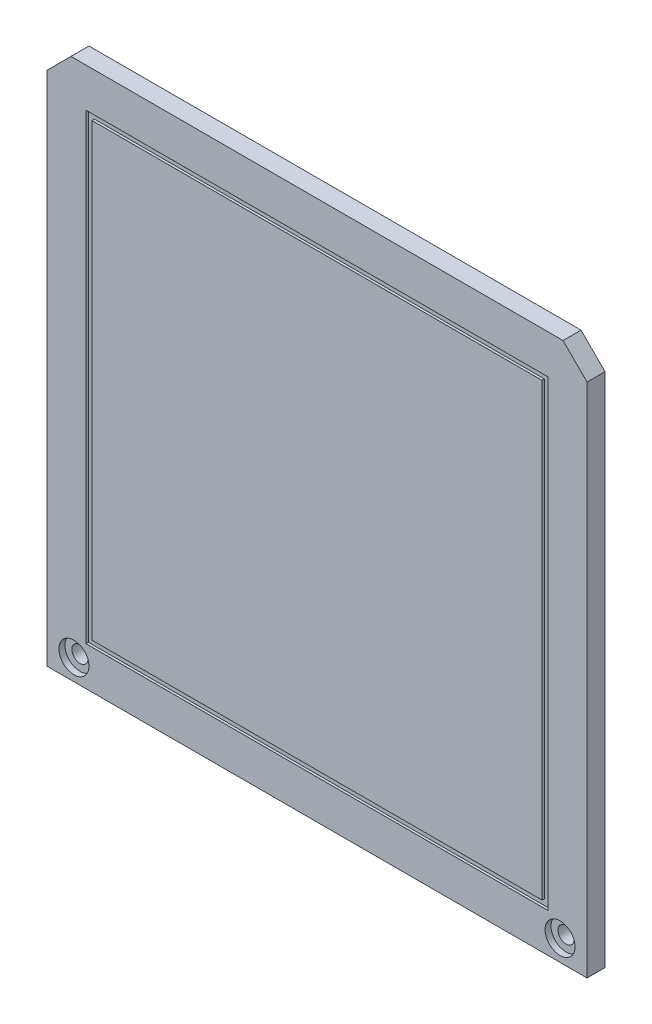
ISO-10303-21;
HEADER;
FILE_DESCRIPTION(('STEP AP214'),'2;1');
FILE_NAME('part.step','',(''),(''),'','','');
FILE_SCHEMA(('AUTOMOTIVE_DESIGN { 1 0 10303 214 1 1 1 1 }'));
ENDSEC;
DATA;
#1=APPLICATION_CONTEXT('core data for automotive mechanical design processes');
#2=APPLICATION_PROTOCOL_DEFINITION('international standard','automotive_design',2000,#1);
#3=PRODUCT_CONTEXT('',#1,'mechanical');
#4=PRODUCT('Part','Part','',(#3));
#5=PRODUCT_RELATED_PRODUCT_CATEGORY('part','',(#4));
#6=PRODUCT_DEFINITION_FORMATION('','',#4);
#7=PRODUCT_DEFINITION_CONTEXT('part definition',#1,'design');
#8=PRODUCT_DEFINITION('design','',#6,#7);
#9=PRODUCT_DEFINITION_SHAPE('','',#8);
#10=(LENGTH_UNIT() NAMED_UNIT(*) SI_UNIT(.MILLI.,.METRE.));
#11=(NAMED_UNIT(*) PLANE_ANGLE_UNIT() SI_UNIT($,.RADIAN.));
#12=(NAMED_UNIT(*) SI_UNIT($,.STERADIAN.) SOLID_ANGLE_UNIT());
#13=UNCERTAINTY_MEASURE_WITH_UNIT(LENGTH_MEASURE(1.E-05),#10,'distance_accuracy_value','');
#14=(GEOMETRIC_REPRESENTATION_CONTEXT(3) GLOBAL_UNCERTAINTY_ASSIGNED_CONTEXT((#13)) GLOBAL_UNIT_ASSIGNED_CONTEXT((#10,
#11,#12)) REPRESENTATION_CONTEXT('',''));
#15=CARTESIAN_POINT('',(0.,0.,0.));
#16=DIRECTION('',(0.,0.,1.));
#17=DIRECTION('',(1.,0.,0.));
#18=AXIS2_PLACEMENT_3D('',#15,#16,#17);
#19=CARTESIAN_POINT('',(40.5,-41.5,0.));
#20=DIRECTION('',(0.,0.,1.));
#21=DIRECTION('',(1.,0.,0.));
#22=AXIS2_PLACEMENT_3D('',#19,#20,#21);
#23=CYLINDRICAL_SURFACE('',#22,1.35000000000001);
#24=CARTESIAN_POINT('',(40.5,-41.5,0.));
#25=DIRECTION('',(0.,0.,1.));
#26=DIRECTION('',(1.,0.,0.));
#27=AXIS2_PLACEMENT_3D('',#24,#25,#26);
#28=CIRCLE('',#27,1.35000000000001);
#29=CARTESIAN_POINT('',(41.85,-41.5,0.));
#30=VERTEX_POINT('',#29);
#31=EDGE_CURVE('E339',#30,#30,#28,.T.);
#32=ORIENTED_EDGE('',*,*,#31,.F.);
#33=EDGE_LOOP('',(#32));
#34=FACE_BOUND('',#33,.T.);
#35=CARTESIAN_POINT('',(40.5,-41.5,2.));
#36=DIRECTION('',(0.,0.,1.));
#37=DIRECTION('',(1.,0.,0.));
#38=AXIS2_PLACEMENT_3D('',#35,#36,#37);
#39=CIRCLE('',#38,1.35000000000001);
#40=CARTESIAN_POINT('',(41.85,-41.5,2.));
#41=VERTEX_POINT('',#40);
#42=EDGE_CURVE('E51',#41,#41,#39,.F.);
#43=ORIENTED_EDGE('',*,*,#42,.F.);
#44=EDGE_LOOP('',(#43));
#45=FACE_BOUND('',#44,.T.);
#46=ADVANCED_FACE('F46',(#34,#45),#23,.F.);
#47=CARTESIAN_POINT('',(-40.5,-41.5,0.));
#48=DIRECTION('',(0.,0.,1.));
#49=DIRECTION('',(1.,0.,0.));
#50=AXIS2_PLACEMENT_3D('',#47,#48,#49);
#51=CYLINDRICAL_SURFACE('',#50,1.35000000000001);
#52=CARTESIAN_POINT('',(-40.5,-41.5,0.));
#53=DIRECTION('',(0.,0.,1.));
#54=DIRECTION('',(1.,0.,0.));
#55=AXIS2_PLACEMENT_3D('',#52,#53,#54);
#56=CIRCLE('',#55,1.35000000000001);
#57=CARTESIAN_POINT('',(-39.15,-41.5,0.));
#58=VERTEX_POINT('',#57);
#59=EDGE_CURVE('E346',#58,#58,#56,.T.);
#60=ORIENTED_EDGE('',*,*,#59,.F.);
#61=EDGE_LOOP('',(#60));
#62=FACE_BOUND('',#61,.T.);
#63=CARTESIAN_POINT('',(-40.5,-41.5,2.));
#64=DIRECTION('',(0.,0.,1.));
#65=DIRECTION('',(1.,0.,0.));
#66=AXIS2_PLACEMENT_3D('',#63,#64,#65);
#67=CIRCLE('',#66,1.35000000000001);
#68=CARTESIAN_POINT('',(-39.15,-41.5,2.));
#69=VERTEX_POINT('',#68);
#70=EDGE_CURVE('E385',#69,#69,#67,.F.);
#71=ORIENTED_EDGE('',*,*,#70,.F.);
#72=EDGE_LOOP('',(#71));
#73=FACE_BOUND('',#72,.T.);
#74=ADVANCED_FACE('F441',(#62,#73),#51,.F.);
#75=CARTESIAN_POINT('',(45.,-45.,3.));
#76=DIRECTION('',(-1.,0.,0.));
#77=DIRECTION('',(0.,0.,1.));
#78=AXIS2_PLACEMENT_3D('',#75,#76,#77);
#79=PLANE('',#78);
#80=DIRECTION('',(0.,1.,0.));
#81=VECTOR('',#80,1.);
#82=CARTESIAN_POINT('',(45.,-45.,0.));
#83=LINE('',#82,#81);
#84=CARTESIAN_POINT('',(45.,-45.,0.));
#85=VERTEX_POINT('',#84);
#86=CARTESIAN_POINT('',(45.,41.,0.));
#87=VERTEX_POINT('',#86);
#88=EDGE_CURVE('E349',#85,#87,#83,.T.);
#89=ORIENTED_EDGE('',*,*,#88,.T.);
#90=DIRECTION('',(0.,0.,1.));
#91=VECTOR('',#90,1.);
#92=CARTESIAN_POINT('',(45.,41.,3.));
#93=LINE('',#92,#91);
#94=CARTESIAN_POINT('',(45.,41.,3.));
#95=VERTEX_POINT('',#94);
#96=EDGE_CURVE('E72',#87,#95,#93,.T.);
#97=ORIENTED_EDGE('',*,*,#96,.T.);
#98=DIRECTION('',(0.,1.,0.));
#99=VECTOR('',#98,1.);
#100=CARTESIAN_POINT('',(45.,-45.,3.));
#101=LINE('',#100,#99);
#102=CARTESIAN_POINT('',(45.,-45.,3.));
#103=VERTEX_POINT('',#102);
#104=EDGE_CURVE('E352',#103,#95,#101,.T.);
#105=ORIENTED_EDGE('',*,*,#104,.F.);
#106=DIRECTION('',(0.,0.,-1.));
#107=VECTOR('',#106,1.);
#108=CARTESIAN_POINT('',(45.,-45.,3.));
#109=LINE('',#108,#107);
#110=EDGE_CURVE('E361',#103,#85,#109,.T.);
#111=ORIENTED_EDGE('',*,*,#110,.T.);
#112=EDGE_LOOP('',(#89,#97,#105,#111));
#113=FACE_BOUND('',#112,.T.);
#114=ADVANCED_FACE('F439',(#113),#79,.F.);
#115=CARTESIAN_POINT('',(-45.,45.,3.));
#116=DIRECTION('',(0.,-1.,0.));
#117=DIRECTION('',(0.,0.,-1.));
#118=AXIS2_PLACEMENT_3D('',#115,#116,#117);
#119=PLANE('',#118);
#120=DIRECTION('',(-1.,0.,0.));
#121=VECTOR('',#120,1.);
#122=CARTESIAN_POINT('',(-45.,45.,3.));
#123=LINE('',#122,#121);
#124=CARTESIAN_POINT('',(41.,45.,3.));
#125=VERTEX_POINT('',#124);
#126=CARTESIAN_POINT('',(-41.,45.,3.));
#127=VERTEX_POINT('',#126);
#128=EDGE_CURVE('E354',#125,#127,#123,.T.);
#129=ORIENTED_EDGE('',*,*,#128,.F.);
#130=DIRECTION('',(0.,0.,-1.));
#131=VECTOR('',#130,1.);
#132=CARTESIAN_POINT('',(41.,45.,3.));
#133=LINE('',#132,#131);
#134=CARTESIAN_POINT('',(41.,45.,0.));
#135=VERTEX_POINT('',#134);
#136=EDGE_CURVE('E376',#125,#135,#133,.T.);
#137=ORIENTED_EDGE('',*,*,#136,.T.);
#138=DIRECTION('',(-1.,0.,0.));
#139=VECTOR('',#138,1.);
#140=CARTESIAN_POINT('',(-45.,45.,0.));
#141=LINE('',#140,#139);
#142=CARTESIAN_POINT('',(-41.,45.,0.));
#143=VERTEX_POINT('',#142);
#144=EDGE_CURVE('E363',#135,#143,#141,.T.);
#145=ORIENTED_EDGE('',*,*,#144,.T.);
#146=DIRECTION('',(0.,0.,1.));
#147=VECTOR('',#146,1.);
#148=CARTESIAN_POINT('',(-41.,45.,3.));
#149=LINE('',#148,#147);
#150=EDGE_CURVE('E374',#143,#127,#149,.T.);
#151=ORIENTED_EDGE('',*,*,#150,.T.);
#152=EDGE_LOOP('',(#129,#137,#145,#151));
#153=FACE_BOUND('',#152,.T.);
#154=ADVANCED_FACE('F427',(#153),#119,.F.);
#155=CARTESIAN_POINT('',(-45.,-45.,3.));
#156=DIRECTION('',(1.,0.,0.));
#157=DIRECTION('',(0.,0.,-1.));
#158=AXIS2_PLACEMENT_3D('',#155,#156,#157);
#159=PLANE('',#158);
#160=DIRECTION('',(0.,-1.,0.));
#161=VECTOR('',#160,1.);
#162=CARTESIAN_POINT('',(-45.,-45.,3.));
#163=LINE('',#162,#161);
#164=CARTESIAN_POINT('',(-45.,41.,3.));
#165=VERTEX_POINT('',#164);
#166=CARTESIAN_POINT('',(-45.,-45.,3.));
#167=VERTEX_POINT('',#166);
#168=EDGE_CURVE('E357',#165,#167,#163,.T.);
#169=ORIENTED_EDGE('',*,*,#168,.F.);
#170=DIRECTION('',(0.,0.,-1.));
#171=VECTOR('',#170,1.);
#172=CARTESIAN_POINT('',(-45.,41.,3.));
#173=LINE('',#172,#171);
#174=CARTESIAN_POINT('',(-45.,41.,0.));
#175=VERTEX_POINT('',#174);
#176=EDGE_CURVE('E12',#165,#175,#173,.T.);
#177=ORIENTED_EDGE('',*,*,#176,.T.);
#178=DIRECTION('',(0.,-1.,0.));
#179=VECTOR('',#178,1.);
#180=CARTESIAN_POINT('',(-45.,-45.,0.));
#181=LINE('',#180,#179);
#182=CARTESIAN_POINT('',(-45.,-45.,0.));
#183=VERTEX_POINT('',#182);
#184=EDGE_CURVE('E366',#175,#183,#181,.T.);
#185=ORIENTED_EDGE('',*,*,#184,.T.);
#186=DIRECTION('',(0.,0.,-1.));
#187=VECTOR('',#186,1.);
#188=CARTESIAN_POINT('',(-45.,-45.,3.));
#189=LINE('',#188,#187);
#190=EDGE_CURVE('E371',#167,#183,#189,.T.);
#191=ORIENTED_EDGE('',*,*,#190,.F.);
#192=EDGE_LOOP('',(#169,#177,#185,#191));
#193=FACE_BOUND('',#192,.T.);
#194=ADVANCED_FACE('F436',(#193),#159,.F.);
#195=CARTESIAN_POINT('',(-45.,-45.,3.));
#196=DIRECTION('',(0.,1.,0.));
#197=DIRECTION('',(0.,0.,1.));
#198=AXIS2_PLACEMENT_3D('',#195,#196,#197);
#199=PLANE('',#198);
#200=DIRECTION('',(1.,0.,0.));
#201=VECTOR('',#200,1.);
#202=CARTESIAN_POINT('',(-45.,-45.,0.));
#203=LINE('',#202,#201);
#204=EDGE_CURVE('E355',#183,#85,#203,.T.);
#205=ORIENTED_EDGE('',*,*,#204,.T.);
#206=ORIENTED_EDGE('',*,*,#110,.F.);
#207=DIRECTION('',(1.,0.,0.));
#208=VECTOR('',#207,1.);
#209=CARTESIAN_POINT('',(-45.,-45.,3.));
#210=LINE('',#209,#208);
#211=EDGE_CURVE('E359',#167,#103,#210,.T.);
#212=ORIENTED_EDGE('',*,*,#211,.F.);
#213=ORIENTED_EDGE('',*,*,#190,.T.);
#214=EDGE_LOOP('',(#205,#206,#212,#213));
#215=FACE_BOUND('',#214,.T.);
#216=ADVANCED_FACE('F411',(#215),#199,.F.);
#217=CARTESIAN_POINT('',(0.,0.,3.));
#218=DIRECTION('',(0.,0.,-1.));
#219=DIRECTION('',(-1.,0.,0.));
#220=AXIS2_PLACEMENT_3D('',#217,#218,#219);
#221=PLANE('',#220);
#222=CARTESIAN_POINT('',(-40.5,-41.5,3.));
#223=DIRECTION('',(0.,0.,1.));
#224=DIRECTION('',(1.,0.,0.));
#225=AXIS2_PLACEMENT_3D('',#222,#223,#224);
#226=CIRCLE('',#225,2.5);
#227=CARTESIAN_POINT('',(-38.,-41.5,3.));
#228=VERTEX_POINT('',#227);
#229=EDGE_CURVE('E392',#228,#228,#226,.T.);
#230=ORIENTED_EDGE('',*,*,#229,.F.);
#231=EDGE_LOOP('',(#230));
#232=FACE_BOUND('',#231,.T.);
#233=CARTESIAN_POINT('',(40.5,-41.5,3.));
#234=DIRECTION('',(0.,0.,1.));
#235=DIRECTION('',(1.,0.,0.));
#236=AXIS2_PLACEMENT_3D('',#233,#234,#235);
#237=CIRCLE('',#236,2.5);
#238=CARTESIAN_POINT('',(43.,-41.5,3.));
#239=VERTEX_POINT('',#238);
#240=EDGE_CURVE('E234',#239,#239,#237,.T.);
#241=ORIENTED_EDGE('',*,*,#240,.F.);
#242=EDGE_LOOP('',(#241));
#243=FACE_BOUND('',#242,.T.);
#244=DIRECTION('',(-1.,0.,0.));
#245=VECTOR('',#244,1.);
#246=CARTESIAN_POINT('',(-38.5,38.5,3.));
#247=LINE('',#246,#245);
#248=CARTESIAN_POINT('',(38.5,38.5,3.));
#249=VERTEX_POINT('',#248);
#250=CARTESIAN_POINT('',(-38.5,38.5,3.));
#251=VERTEX_POINT('',#250);
#252=EDGE_CURVE('E329',#249,#251,#247,.T.);
#253=ORIENTED_EDGE('',*,*,#252,.F.);
#254=DIRECTION('',(0.,1.,0.));
#255=VECTOR('',#254,1.);
#256=CARTESIAN_POINT('',(38.5,-38.5,3.));
#257=LINE('',#256,#255);
#258=CARTESIAN_POINT('',(38.5,-38.5,3.));
#259=VERTEX_POINT('',#258);
#260=EDGE_CURVE('E307',#259,#249,#257,.T.);
#261=ORIENTED_EDGE('',*,*,#260,.F.);
#262=DIRECTION('',(1.,0.,0.));
#263=VECTOR('',#262,1.);
#264=CARTESIAN_POINT('',(-38.5,-38.5,3.));
#265=LINE('',#264,#263);
#266=CARTESIAN_POINT('',(-38.5,-38.5,3.));
#267=VERTEX_POINT('',#266);
#268=EDGE_CURVE('E318',#267,#259,#265,.T.);
#269=ORIENTED_EDGE('',*,*,#268,.F.);
#270=DIRECTION('',(0.,-1.,0.));
#271=VECTOR('',#270,1.);
#272=CARTESIAN_POINT('',(-38.5,-38.5,3.));
#273=LINE('',#272,#271);
#274=EDGE_CURVE('E332',#251,#267,#273,.T.);
#275=ORIENTED_EDGE('',*,*,#274,.F.);
#276=EDGE_LOOP('',(#253,#261,#269,#275));
#277=FACE_BOUND('',#276,.T.);
#278=ORIENTED_EDGE('',*,*,#104,.T.);
#279=DIRECTION('',(0.707106781186546,-0.707106781186549,0.));
#280=VECTOR('',#279,1.);
#281=CARTESIAN_POINT('',(41.,45.,3.));
#282=LINE('',#281,#280);
#283=EDGE_CURVE('E56',#95,#125,#282,.F.);
#284=ORIENTED_EDGE('',*,*,#283,.T.);
#285=ORIENTED_EDGE('',*,*,#128,.T.);
#286=DIRECTION('',(0.707106781186549,0.707106781186546,0.));
#287=VECTOR('',#286,1.);
#288=CARTESIAN_POINT('',(-45.,41.,3.));
#289=LINE('',#288,#287);
#290=EDGE_CURVE('E64',#127,#165,#289,.F.);
#291=ORIENTED_EDGE('',*,*,#290,.T.);
#292=ORIENTED_EDGE('',*,*,#168,.T.);
#293=ORIENTED_EDGE('',*,*,#211,.T.);
#294=EDGE_LOOP('',(#278,#284,#285,#291,#292,#293));
#295=FACE_BOUND('',#294,.T.);
#296=ADVANCED_FACE('F407',(#232,#243,#277,#295),#221,.F.);
#297=CARTESIAN_POINT('',(0.,0.,0.));
#298=DIRECTION('',(0.,0.,-1.));
#299=DIRECTION('',(-1.,0.,0.));
#300=AXIS2_PLACEMENT_3D('',#297,#298,#299);
#301=PLANE('',#300);
#302=DIRECTION('',(-1.,0.,0.));
#303=VECTOR('',#302,1.);
#304=CARTESIAN_POINT('',(38.5,-38.5,0.));
#305=LINE('',#304,#303);
#306=CARTESIAN_POINT('',(38.5,-38.5,0.));
#307=VERTEX_POINT('',#306);
#308=CARTESIAN_POINT('',(-38.5,-38.5,0.));
#309=VERTEX_POINT('',#308);
#310=EDGE_CURVE('E245',#307,#309,#305,.T.);
#311=ORIENTED_EDGE('',*,*,#310,.F.);
#312=DIRECTION('',(0.,-1.,0.));
#313=VECTOR('',#312,1.);
#314=CARTESIAN_POINT('',(38.5,38.5,0.));
#315=LINE('',#314,#313);
#316=CARTESIAN_POINT('',(38.5,38.5,0.));
#317=VERTEX_POINT('',#316);
#318=EDGE_CURVE('E253',#317,#307,#315,.T.);
#319=ORIENTED_EDGE('',*,*,#318,.F.);
#320=DIRECTION('',(1.,0.,0.));
#321=VECTOR('',#320,1.);
#322=CARTESIAN_POINT('',(-38.5,38.5,0.));
#323=LINE('',#322,#321);
#324=CARTESIAN_POINT('',(-38.5,38.5,0.));
#325=VERTEX_POINT('',#324);
#326=EDGE_CURVE('E267',#325,#317,#323,.T.);
#327=ORIENTED_EDGE('',*,*,#326,.F.);
#328=DIRECTION('',(0.,1.,0.));
#329=VECTOR('',#328,1.);
#330=CARTESIAN_POINT('',(-38.5,-38.5,0.));
#331=LINE('',#330,#329);
#332=EDGE_CURVE('E264',#309,#325,#331,.T.);
#333=ORIENTED_EDGE('',*,*,#332,.F.);
#334=EDGE_LOOP('',(#311,#319,#327,#333));
#335=FACE_BOUND('',#334,.T.);
#336=ORIENTED_EDGE('',*,*,#59,.T.);
#337=EDGE_LOOP('',(#336));
#338=FACE_BOUND('',#337,.T.);
#339=ORIENTED_EDGE('',*,*,#31,.T.);
#340=EDGE_LOOP('',(#339));
#341=FACE_BOUND('',#340,.T.);
#342=ORIENTED_EDGE('',*,*,#144,.F.);
#343=DIRECTION('',(-0.707106781186546,0.707106781186549,0.));
#344=VECTOR('',#343,1.);
#345=CARTESIAN_POINT('',(43.0000000000001,42.9999999999999,0.));
#346=LINE('',#345,#344);
#347=EDGE_CURVE('E381',#135,#87,#346,.F.);
#348=ORIENTED_EDGE('',*,*,#347,.T.);
#349=ORIENTED_EDGE('',*,*,#88,.F.);
#350=ORIENTED_EDGE('',*,*,#204,.F.);
#351=ORIENTED_EDGE('',*,*,#184,.F.);
#352=DIRECTION('',(-0.707106781186549,-0.707106781186546,0.));
#353=VECTOR('',#352,1.);
#354=CARTESIAN_POINT('',(-42.9999999999999,43.0000000000001,0.));
#355=LINE('',#354,#353);
#356=EDGE_CURVE('E379',#175,#143,#355,.F.);
#357=ORIENTED_EDGE('',*,*,#356,.T.);
#358=EDGE_LOOP('',(#342,#348,#349,#350,#351,#357));
#359=FACE_BOUND('',#358,.T.);
#360=ADVANCED_FACE('F410',(#335,#338,#341,#359),#301,.T.);
#361=CARTESIAN_POINT('',(38.5,-38.5,2.6));
#362=DIRECTION('',(1.,0.,0.));
#363=DIRECTION('',(0.,0.,-1.));
#364=AXIS2_PLACEMENT_3D('',#361,#362,#363);
#365=PLANE('',#364);
#366=ORIENTED_EDGE('',*,*,#260,.T.);
#367=DIRECTION('',(0.,0.,1.));
#368=VECTOR('',#367,1.);
#369=CARTESIAN_POINT('',(38.5,38.5,2.6));
#370=LINE('',#369,#368);
#371=CARTESIAN_POINT('',(38.5,38.5,2.6));
#372=VERTEX_POINT('',#371);
#373=EDGE_CURVE('E327',#372,#249,#370,.T.);
#374=ORIENTED_EDGE('',*,*,#373,.F.);
#375=DIRECTION('',(0.,1.,0.));
#376=VECTOR('',#375,1.);
#377=CARTESIAN_POINT('',(38.5,-38.5,2.6));
#378=LINE('',#377,#376);
#379=CARTESIAN_POINT('',(38.5,-38.5,2.6));
#380=VERTEX_POINT('',#379);
#381=EDGE_CURVE('E314',#380,#372,#378,.T.);
#382=ORIENTED_EDGE('',*,*,#381,.F.);
#383=DIRECTION('',(0.,0.,1.));
#384=VECTOR('',#383,1.);
#385=CARTESIAN_POINT('',(38.5,-38.5,2.6));
#386=LINE('',#385,#384);
#387=EDGE_CURVE('E337',#380,#259,#386,.T.);
#388=ORIENTED_EDGE('',*,*,#387,.T.);
#389=EDGE_LOOP('',(#366,#374,#382,#388));
#390=FACE_BOUND('',#389,.T.);
#391=ADVANCED_FACE('F461',(#390),#365,.F.);
#392=CARTESIAN_POINT('',(-38.5,-38.5,2.6));
#393=DIRECTION('',(0.,-1.,0.));
#394=DIRECTION('',(0.,0.,-1.));
#395=AXIS2_PLACEMENT_3D('',#392,#393,#394);
#396=PLANE('',#395);
#397=ORIENTED_EDGE('',*,*,#268,.T.);
#398=ORIENTED_EDGE('',*,*,#387,.F.);
#399=DIRECTION('',(1.,0.,0.));
#400=VECTOR('',#399,1.);
#401=CARTESIAN_POINT('',(-38.5,-38.5,2.6));
#402=LINE('',#401,#400);
#403=CARTESIAN_POINT('',(-38.5,-38.5,2.6));
#404=VERTEX_POINT('',#403);
#405=EDGE_CURVE('E324',#404,#380,#402,.T.);
#406=ORIENTED_EDGE('',*,*,#405,.F.);
#407=DIRECTION('',(0.,0.,1.));
#408=VECTOR('',#407,1.);
#409=CARTESIAN_POINT('',(-38.5,-38.5,2.6));
#410=LINE('',#409,#408);
#411=EDGE_CURVE('E340',#404,#267,#410,.T.);
#412=ORIENTED_EDGE('',*,*,#411,.T.);
#413=EDGE_LOOP('',(#397,#398,#406,#412));
#414=FACE_BOUND('',#413,.T.);
#415=ADVANCED_FACE('F492',(#414),#396,.F.);
#416=CARTESIAN_POINT('',(-38.5,-38.5,2.6));
#417=DIRECTION('',(-1.,0.,0.));
#418=DIRECTION('',(0.,0.,1.));
#419=AXIS2_PLACEMENT_3D('',#416,#417,#418);
#420=PLANE('',#419);
#421=ORIENTED_EDGE('',*,*,#274,.T.);
#422=ORIENTED_EDGE('',*,*,#411,.F.);
#423=DIRECTION('',(0.,-1.,0.));
#424=VECTOR('',#423,1.);
#425=CARTESIAN_POINT('',(-38.5,-38.5,2.6));
#426=LINE('',#425,#424);
#427=CARTESIAN_POINT('',(-38.5,38.5,2.6));
#428=VERTEX_POINT('',#427);
#429=EDGE_CURVE('E321',#428,#404,#426,.T.);
#430=ORIENTED_EDGE('',*,*,#429,.F.);
#431=DIRECTION('',(0.,0.,1.));
#432=VECTOR('',#431,1.);
#433=CARTESIAN_POINT('',(-38.5,38.5,2.6));
#434=LINE('',#433,#432);
#435=EDGE_CURVE('E342',#428,#251,#434,.T.);
#436=ORIENTED_EDGE('',*,*,#435,.T.);
#437=EDGE_LOOP('',(#421,#422,#430,#436));
#438=FACE_BOUND('',#437,.T.);
#439=ADVANCED_FACE('F499',(#438),#420,.F.);
#440=CARTESIAN_POINT('',(-38.5,38.5,2.6));
#441=DIRECTION('',(0.,1.,0.));
#442=DIRECTION('',(0.,0.,1.));
#443=AXIS2_PLACEMENT_3D('',#440,#441,#442);
#444=PLANE('',#443);
#445=ORIENTED_EDGE('',*,*,#252,.T.);
#446=ORIENTED_EDGE('',*,*,#435,.F.);
#447=DIRECTION('',(-1.,0.,0.));
#448=VECTOR('',#447,1.);
#449=CARTESIAN_POINT('',(-38.5,38.5,2.6));
#450=LINE('',#449,#448);
#451=EDGE_CURVE('E317',#372,#428,#450,.T.);
#452=ORIENTED_EDGE('',*,*,#451,.F.);
#453=ORIENTED_EDGE('',*,*,#373,.T.);
#454=EDGE_LOOP('',(#445,#446,#452,#453));
#455=FACE_BOUND('',#454,.T.);
#456=ADVANCED_FACE('F507',(#455),#444,.F.);
#457=CARTESIAN_POINT('',(0.,0.,2.6));
#458=DIRECTION('',(0.,0.,-1.));
#459=DIRECTION('',(-1.,0.,0.));
#460=AXIS2_PLACEMENT_3D('',#457,#458,#459);
#461=PLANE('',#460);
#462=DIRECTION('',(0.,1.,0.));
#463=VECTOR('',#462,1.);
#464=CARTESIAN_POINT('',(37.5,-37.5,2.6));
#465=LINE('',#464,#463);
#466=CARTESIAN_POINT('',(37.5,-37.5,2.6));
#467=VERTEX_POINT('',#466);
#468=CARTESIAN_POINT('',(37.5,37.5,2.6));
#469=VERTEX_POINT('',#468);
#470=EDGE_CURVE('E281',#467,#469,#465,.T.);
#471=ORIENTED_EDGE('',*,*,#470,.F.);
#472=DIRECTION('',(1.,0.,0.));
#473=VECTOR('',#472,1.);
#474=CARTESIAN_POINT('',(-37.5,-37.5,2.6));
#475=LINE('',#474,#473);
#476=CARTESIAN_POINT('',(-37.5,-37.5,2.6));
#477=VERTEX_POINT('',#476);
#478=EDGE_CURVE('E291',#477,#467,#475,.T.);
#479=ORIENTED_EDGE('',*,*,#478,.F.);
#480=DIRECTION('',(0.,-1.,0.));
#481=VECTOR('',#480,1.);
#482=CARTESIAN_POINT('',(-37.5,-37.5,2.6));
#483=LINE('',#482,#481);
#484=CARTESIAN_POINT('',(-37.5,37.5,2.6));
#485=VERTEX_POINT('',#484);
#486=EDGE_CURVE('E288',#485,#477,#483,.T.);
#487=ORIENTED_EDGE('',*,*,#486,.F.);
#488=DIRECTION('',(-1.,0.,0.));
#489=VECTOR('',#488,1.);
#490=CARTESIAN_POINT('',(-37.5,37.5,2.6));
#491=LINE('',#490,#489);
#492=EDGE_CURVE('E284',#469,#485,#491,.T.);
#493=ORIENTED_EDGE('',*,*,#492,.F.);
#494=EDGE_LOOP('',(#471,#479,#487,#493));
#495=FACE_BOUND('',#494,.T.);
#496=ORIENTED_EDGE('',*,*,#381,.T.);
#497=ORIENTED_EDGE('',*,*,#451,.T.);
#498=ORIENTED_EDGE('',*,*,#429,.T.);
#499=ORIENTED_EDGE('',*,*,#405,.T.);
#500=EDGE_LOOP('',(#496,#497,#498,#499));
#501=FACE_BOUND('',#500,.T.);
#502=ADVANCED_FACE('F515',(#495,#501),#461,.F.);
#503=CARTESIAN_POINT('',(37.5,-37.5,2.6));
#504=DIRECTION('',(1.,0.,0.));
#505=DIRECTION('',(0.,0.,-1.));
#506=AXIS2_PLACEMENT_3D('',#503,#504,#505);
#507=PLANE('',#506);
#508=DIRECTION('',(0.,1.,0.));
#509=VECTOR('',#508,1.);
#510=CARTESIAN_POINT('',(37.5,-37.5,3.));
#511=LINE('',#510,#509);
#512=CARTESIAN_POINT('',(37.5,-37.5,3.));
#513=VERTEX_POINT('',#512);
#514=CARTESIAN_POINT('',(37.5,37.5,3.));
#515=VERTEX_POINT('',#514);
#516=EDGE_CURVE('E274',#513,#515,#511,.T.);
#517=ORIENTED_EDGE('',*,*,#516,.F.);
#518=DIRECTION('',(0.,0.,1.));
#519=VECTOR('',#518,1.);
#520=CARTESIAN_POINT('',(37.5,-37.5,2.6));
#521=LINE('',#520,#519);
#522=EDGE_CURVE('E305',#467,#513,#521,.T.);
#523=ORIENTED_EDGE('',*,*,#522,.F.);
#524=ORIENTED_EDGE('',*,*,#470,.T.);
#525=DIRECTION('',(0.,0.,1.));
#526=VECTOR('',#525,1.);
#527=CARTESIAN_POINT('',(37.5,37.5,2.6));
#528=LINE('',#527,#526);
#529=EDGE_CURVE('E294',#469,#515,#528,.T.);
#530=ORIENTED_EDGE('',*,*,#529,.T.);
#531=EDGE_LOOP('',(#517,#523,#524,#530));
#532=FACE_BOUND('',#531,.T.);
#533=ADVANCED_FACE('F523',(#532),#507,.T.);
#534=CARTESIAN_POINT('',(-37.5,-37.5,2.6));
#535=DIRECTION('',(0.,-1.,0.));
#536=DIRECTION('',(0.,0.,-1.));
#537=AXIS2_PLACEMENT_3D('',#534,#535,#536);
#538=PLANE('',#537);
#539=DIRECTION('',(1.,0.,0.));
#540=VECTOR('',#539,1.);
#541=CARTESIAN_POINT('',(-37.5,-37.5,3.));
#542=LINE('',#541,#540);
#543=CARTESIAN_POINT('',(-37.5,-37.5,3.));
#544=VERTEX_POINT('',#543);
#545=EDGE_CURVE('E285',#544,#513,#542,.T.);
#546=ORIENTED_EDGE('',*,*,#545,.F.);
#547=DIRECTION('',(0.,0.,1.));
#548=VECTOR('',#547,1.);
#549=CARTESIAN_POINT('',(-37.5,-37.5,2.6));
#550=LINE('',#549,#548);
#551=EDGE_CURVE('E308',#477,#544,#550,.T.);
#552=ORIENTED_EDGE('',*,*,#551,.F.);
#553=ORIENTED_EDGE('',*,*,#478,.T.);
#554=ORIENTED_EDGE('',*,*,#522,.T.);
#555=EDGE_LOOP('',(#546,#552,#553,#554));
#556=FACE_BOUND('',#555,.T.);
#557=ADVANCED_FACE('F531',(#556),#538,.T.);
#558=CARTESIAN_POINT('',(-37.5,-37.5,2.6));
#559=DIRECTION('',(-1.,0.,0.));
#560=DIRECTION('',(0.,0.,1.));
#561=AXIS2_PLACEMENT_3D('',#558,#559,#560);
#562=PLANE('',#561);
#563=DIRECTION('',(0.,-1.,0.));
#564=VECTOR('',#563,1.);
#565=CARTESIAN_POINT('',(-37.5,-37.5,3.));
#566=LINE('',#565,#564);
#567=CARTESIAN_POINT('',(-37.5,37.5,3.));
#568=VERTEX_POINT('',#567);
#569=EDGE_CURVE('E300',#568,#544,#566,.T.);
#570=ORIENTED_EDGE('',*,*,#569,.F.);
#571=DIRECTION('',(0.,0.,1.));
#572=VECTOR('',#571,1.);
#573=CARTESIAN_POINT('',(-37.5,37.5,2.6));
#574=LINE('',#573,#572);
#575=EDGE_CURVE('E310',#485,#568,#574,.T.);
#576=ORIENTED_EDGE('',*,*,#575,.F.);
#577=ORIENTED_EDGE('',*,*,#486,.T.);
#578=ORIENTED_EDGE('',*,*,#551,.T.);
#579=EDGE_LOOP('',(#570,#576,#577,#578));
#580=FACE_BOUND('',#579,.T.);
#581=ADVANCED_FACE('F539',(#580),#562,.T.);
#582=CARTESIAN_POINT('',(-37.5,37.5,2.6));
#583=DIRECTION('',(0.,1.,0.));
#584=DIRECTION('',(0.,0.,1.));
#585=AXIS2_PLACEMENT_3D('',#582,#583,#584);
#586=PLANE('',#585);
#587=DIRECTION('',(-1.,0.,0.));
#588=VECTOR('',#587,1.);
#589=CARTESIAN_POINT('',(-37.5,37.5,3.));
#590=LINE('',#589,#588);
#591=EDGE_CURVE('E297',#515,#568,#590,.T.);
#592=ORIENTED_EDGE('',*,*,#591,.F.);
#593=ORIENTED_EDGE('',*,*,#529,.F.);
#594=ORIENTED_EDGE('',*,*,#492,.T.);
#595=ORIENTED_EDGE('',*,*,#575,.T.);
#596=EDGE_LOOP('',(#592,#593,#594,#595));
#597=FACE_BOUND('',#596,.T.);
#598=ADVANCED_FACE('F547',(#597),#586,.T.);
#599=ORIENTED_EDGE('',*,*,#516,.T.);
#600=ORIENTED_EDGE('',*,*,#591,.T.);
#601=ORIENTED_EDGE('',*,*,#569,.T.);
#602=ORIENTED_EDGE('',*,*,#545,.T.);
#603=EDGE_LOOP('',(#599,#600,#601,#602));
#604=FACE_BOUND('',#603,.T.);
#605=ADVANCED_FACE('F414',(#604),#221,.F.);
#606=CARTESIAN_POINT('',(38.5,-38.5,0.4));
#607=DIRECTION('',(0.,-1.,0.));
#608=DIRECTION('',(0.,0.,-1.));
#609=AXIS2_PLACEMENT_3D('',#606,#607,#608);
#610=PLANE('',#609);
#611=ORIENTED_EDGE('',*,*,#310,.T.);
#612=DIRECTION('',(0.,0.,-1.));
#613=VECTOR('',#612,1.);
#614=CARTESIAN_POINT('',(-38.5,-38.5,0.4));
#615=LINE('',#614,#613);
#616=CARTESIAN_POINT('',(-38.5,-38.5,0.4));
#617=VERTEX_POINT('',#616);
#618=EDGE_CURVE('E262',#617,#309,#615,.T.);
#619=ORIENTED_EDGE('',*,*,#618,.F.);
#620=DIRECTION('',(-1.,0.,0.));
#621=VECTOR('',#620,1.);
#622=CARTESIAN_POINT('',(38.5,-38.5,0.4));
#623=LINE('',#622,#621);
#624=CARTESIAN_POINT('',(38.5,-38.5,0.4));
#625=VERTEX_POINT('',#624);
#626=EDGE_CURVE('E249',#625,#617,#623,.T.);
#627=ORIENTED_EDGE('',*,*,#626,.F.);
#628=DIRECTION('',(0.,0.,-1.));
#629=VECTOR('',#628,1.);
#630=CARTESIAN_POINT('',(38.5,-38.5,0.4));
#631=LINE('',#630,#629);
#632=EDGE_CURVE('E272',#625,#307,#631,.T.);
#633=ORIENTED_EDGE('',*,*,#632,.T.);
#634=EDGE_LOOP('',(#611,#619,#627,#633));
#635=FACE_BOUND('',#634,.T.);
#636=ADVANCED_FACE('F562',(#635),#610,.F.);
#637=CARTESIAN_POINT('',(38.5,38.5,0.4));
#638=DIRECTION('',(1.,0.,0.));
#639=DIRECTION('',(0.,0.,-1.));
#640=AXIS2_PLACEMENT_3D('',#637,#638,#639);
#641=PLANE('',#640);
#642=ORIENTED_EDGE('',*,*,#318,.T.);
#643=ORIENTED_EDGE('',*,*,#632,.F.);
#644=DIRECTION('',(0.,-1.,0.));
#645=VECTOR('',#644,1.);
#646=CARTESIAN_POINT('',(38.5,38.5,0.4));
#647=LINE('',#646,#645);
#648=CARTESIAN_POINT('',(38.5,38.5,0.4));
#649=VERTEX_POINT('',#648);
#650=EDGE_CURVE('E259',#649,#625,#647,.T.);
#651=ORIENTED_EDGE('',*,*,#650,.F.);
#652=DIRECTION('',(0.,0.,-1.));
#653=VECTOR('',#652,1.);
#654=CARTESIAN_POINT('',(38.5,38.5,0.4));
#655=LINE('',#654,#653);
#656=EDGE_CURVE('E275',#649,#317,#655,.T.);
#657=ORIENTED_EDGE('',*,*,#656,.T.);
#658=EDGE_LOOP('',(#642,#643,#651,#657));
#659=FACE_BOUND('',#658,.T.);
#660=ADVANCED_FACE('F569',(#659),#641,.F.);
#661=CARTESIAN_POINT('',(-38.5,38.5,0.4));
#662=DIRECTION('',(0.,1.,0.));
#663=DIRECTION('',(0.,0.,1.));
#664=AXIS2_PLACEMENT_3D('',#661,#662,#663);
#665=PLANE('',#664);
#666=ORIENTED_EDGE('',*,*,#326,.T.);
#667=ORIENTED_EDGE('',*,*,#656,.F.);
#668=DIRECTION('',(1.,0.,0.));
#669=VECTOR('',#668,1.);
#670=CARTESIAN_POINT('',(-38.5,38.5,0.4));
#671=LINE('',#670,#669);
#672=CARTESIAN_POINT('',(-38.5,38.5,0.4));
#673=VERTEX_POINT('',#672);
#674=EDGE_CURVE('E256',#673,#649,#671,.T.);
#675=ORIENTED_EDGE('',*,*,#674,.F.);
#676=DIRECTION('',(0.,0.,-1.));
#677=VECTOR('',#676,1.);
#678=CARTESIAN_POINT('',(-38.5,38.5,0.4));
#679=LINE('',#678,#677);
#680=EDGE_CURVE('E277',#673,#325,#679,.T.);
#681=ORIENTED_EDGE('',*,*,#680,.T.);
#682=EDGE_LOOP('',(#666,#667,#675,#681));
#683=FACE_BOUND('',#682,.T.);
#684=ADVANCED_FACE('F577',(#683),#665,.F.);
#685=CARTESIAN_POINT('',(-38.5,-38.5,0.4));
#686=DIRECTION('',(-1.,0.,0.));
#687=DIRECTION('',(0.,0.,1.));
#688=AXIS2_PLACEMENT_3D('',#685,#686,#687);
#689=PLANE('',#688);
#690=ORIENTED_EDGE('',*,*,#332,.T.);
#691=ORIENTED_EDGE('',*,*,#680,.F.);
#692=DIRECTION('',(0.,1.,0.));
#693=VECTOR('',#692,1.);
#694=CARTESIAN_POINT('',(-38.5,-38.5,0.4));
#695=LINE('',#694,#693);
#696=EDGE_CURVE('E252',#617,#673,#695,.T.);
#697=ORIENTED_EDGE('',*,*,#696,.F.);
#698=ORIENTED_EDGE('',*,*,#618,.T.);
#699=EDGE_LOOP('',(#690,#691,#697,#698));
#700=FACE_BOUND('',#699,.T.);
#701=ADVANCED_FACE('F585',(#700),#689,.F.);
#702=CARTESIAN_POINT('',(0.,0.,0.4));
#703=DIRECTION('',(0.,0.,-1.));
#704=DIRECTION('',(-1.,0.,0.));
#705=AXIS2_PLACEMENT_3D('',#702,#703,#704);
#706=PLANE('',#705);
#707=DIRECTION('',(0.,-1.,0.));
#708=VECTOR('',#707,1.);
#709=CARTESIAN_POINT('',(37.5,37.5,0.4));
#710=LINE('',#709,#708);
#711=CARTESIAN_POINT('',(37.5,37.5,0.4));
#712=VERTEX_POINT('',#711);
#713=CARTESIAN_POINT('',(37.5,-37.5,0.4));
#714=VERTEX_POINT('',#713);
#715=EDGE_CURVE('E213',#712,#714,#710,.T.);
#716=ORIENTED_EDGE('',*,*,#715,.F.);
#717=DIRECTION('',(1.,0.,0.));
#718=VECTOR('',#717,1.);
#719=CARTESIAN_POINT('',(-37.5,37.5,0.4));
#720=LINE('',#719,#718);
#721=CARTESIAN_POINT('',(-37.5,37.5,0.4));
#722=VERTEX_POINT('',#721);
#723=EDGE_CURVE('E223',#722,#712,#720,.T.);
#724=ORIENTED_EDGE('',*,*,#723,.F.);
#725=DIRECTION('',(0.,1.,0.));
#726=VECTOR('',#725,1.);
#727=CARTESIAN_POINT('',(-37.5,-37.5,0.4));
#728=LINE('',#727,#726);
#729=CARTESIAN_POINT('',(-37.5,-37.5,0.4));
#730=VERTEX_POINT('',#729);
#731=EDGE_CURVE('E205',#730,#722,#728,.T.);
#732=ORIENTED_EDGE('',*,*,#731,.F.);
#733=DIRECTION('',(-1.,0.,0.));
#734=VECTOR('',#733,1.);
#735=CARTESIAN_POINT('',(37.5,-37.5,0.4));
#736=LINE('',#735,#734);
#737=EDGE_CURVE('E220',#714,#730,#736,.T.);
#738=ORIENTED_EDGE('',*,*,#737,.F.);
#739=EDGE_LOOP('',(#716,#724,#732,#738));
#740=FACE_BOUND('',#739,.T.);
#741=ORIENTED_EDGE('',*,*,#626,.T.);
#742=ORIENTED_EDGE('',*,*,#696,.T.);
#743=ORIENTED_EDGE('',*,*,#674,.T.);
#744=ORIENTED_EDGE('',*,*,#650,.T.);
#745=EDGE_LOOP('',(#741,#742,#743,#744));
#746=FACE_BOUND('',#745,.T.);
#747=ADVANCED_FACE('F218',(#740,#746),#706,.T.);
#748=CARTESIAN_POINT('',(37.5,-37.5,0.4));
#749=DIRECTION('',(0.,-1.,0.));
#750=DIRECTION('',(0.,0.,-1.));
#751=AXIS2_PLACEMENT_3D('',#748,#749,#750);
#752=PLANE('',#751);
#753=DIRECTION('',(-1.,0.,0.));
#754=VECTOR('',#753,1.);
#755=CARTESIAN_POINT('',(37.5,-37.5,0.));
#756=LINE('',#755,#754);
#757=CARTESIAN_POINT('',(37.5,-37.5,0.));
#758=VERTEX_POINT('',#757);
#759=CARTESIAN_POINT('',(-37.5,-37.5,0.));
#760=VERTEX_POINT('',#759);
#761=EDGE_CURVE('E239',#758,#760,#756,.T.);
#762=ORIENTED_EDGE('',*,*,#761,.F.);
#763=DIRECTION('',(0.,0.,-1.));
#764=VECTOR('',#763,1.);
#765=CARTESIAN_POINT('',(37.5,-37.5,0.4));
#766=LINE('',#765,#764);
#767=EDGE_CURVE('E227',#714,#758,#766,.T.);
#768=ORIENTED_EDGE('',*,*,#767,.F.);
#769=ORIENTED_EDGE('',*,*,#737,.T.);
#770=DIRECTION('',(0.,0.,-1.));
#771=VECTOR('',#770,1.);
#772=CARTESIAN_POINT('',(-37.5,-37.5,0.4));
#773=LINE('',#772,#771);
#774=EDGE_CURVE('E201',#730,#760,#773,.T.);
#775=ORIENTED_EDGE('',*,*,#774,.T.);
#776=EDGE_LOOP('',(#762,#768,#769,#775));
#777=FACE_BOUND('',#776,.T.);
#778=ADVANCED_FACE('F226',(#777),#752,.T.);
#779=CARTESIAN_POINT('',(37.5,37.5,0.4));
#780=DIRECTION('',(1.,0.,0.));
#781=DIRECTION('',(0.,0.,-1.));
#782=AXIS2_PLACEMENT_3D('',#779,#780,#781);
#783=PLANE('',#782);
#784=DIRECTION('',(0.,-1.,0.));
#785=VECTOR('',#784,1.);
#786=CARTESIAN_POINT('',(37.5,37.5,0.));
#787=LINE('',#786,#785);
#788=CARTESIAN_POINT('',(37.5,37.5,0.));
#789=VERTEX_POINT('',#788);
#790=EDGE_CURVE('E228',#789,#758,#787,.T.);
#791=ORIENTED_EDGE('',*,*,#790,.F.);
#792=DIRECTION('',(0.,0.,-1.));
#793=VECTOR('',#792,1.);
#794=CARTESIAN_POINT('',(37.5,37.5,0.4));
#795=LINE('',#794,#793);
#796=EDGE_CURVE('E246',#712,#789,#795,.T.);
#797=ORIENTED_EDGE('',*,*,#796,.F.);
#798=ORIENTED_EDGE('',*,*,#715,.T.);
#799=ORIENTED_EDGE('',*,*,#767,.T.);
#800=EDGE_LOOP('',(#791,#797,#798,#799));
#801=FACE_BOUND('',#800,.T.);
#802=ADVANCED_FACE('F606',(#801),#783,.T.);
#803=CARTESIAN_POINT('',(-37.5,37.5,0.4));
#804=DIRECTION('',(0.,1.,0.));
#805=DIRECTION('',(0.,0.,1.));
#806=AXIS2_PLACEMENT_3D('',#803,#804,#805);
#807=PLANE('',#806);
#808=DIRECTION('',(1.,0.,0.));
#809=VECTOR('',#808,1.);
#810=CARTESIAN_POINT('',(-37.5,37.5,0.));
#811=LINE('',#810,#809);
#812=CARTESIAN_POINT('',(-37.5,37.5,0.));
#813=VERTEX_POINT('',#812);
#814=EDGE_CURVE('E231',#813,#789,#811,.T.);
#815=ORIENTED_EDGE('',*,*,#814,.F.);
#816=DIRECTION('',(0.,0.,-1.));
#817=VECTOR('',#816,1.);
#818=CARTESIAN_POINT('',(-37.5,37.5,0.4));
#819=LINE('',#818,#817);
#820=EDGE_CURVE('E212',#722,#813,#819,.T.);
#821=ORIENTED_EDGE('',*,*,#820,.F.);
#822=ORIENTED_EDGE('',*,*,#723,.T.);
#823=ORIENTED_EDGE('',*,*,#796,.T.);
#824=EDGE_LOOP('',(#815,#821,#822,#823));
#825=FACE_BOUND('',#824,.T.);
#826=ADVANCED_FACE('F613',(#825),#807,.T.);
#827=CARTESIAN_POINT('',(-37.5,-37.5,0.4));
#828=DIRECTION('',(-1.,0.,0.));
#829=DIRECTION('',(0.,0.,1.));
#830=AXIS2_PLACEMENT_3D('',#827,#828,#829);
#831=PLANE('',#830);
#832=DIRECTION('',(0.,1.,0.));
#833=VECTOR('',#832,1.);
#834=CARTESIAN_POINT('',(-37.5,-37.5,0.));
#835=LINE('',#834,#833);
#836=EDGE_CURVE('E207',#760,#813,#835,.T.);
#837=ORIENTED_EDGE('',*,*,#836,.F.);
#838=ORIENTED_EDGE('',*,*,#774,.F.);
#839=ORIENTED_EDGE('',*,*,#731,.T.);
#840=ORIENTED_EDGE('',*,*,#820,.T.);
#841=EDGE_LOOP('',(#837,#838,#839,#840));
#842=FACE_BOUND('',#841,.T.);
#843=ADVANCED_FACE('F203',(#842),#831,.T.);
#844=ORIENTED_EDGE('',*,*,#790,.T.);
#845=ORIENTED_EDGE('',*,*,#761,.T.);
#846=ORIENTED_EDGE('',*,*,#836,.T.);
#847=ORIENTED_EDGE('',*,*,#814,.T.);
#848=EDGE_LOOP('',(#844,#845,#846,#847));
#849=FACE_BOUND('',#848,.T.);
#850=ADVANCED_FACE('F463',(#849),#301,.T.);
#851=CARTESIAN_POINT('',(41.,45.,3.));
#852=DIRECTION('',(-0.707106781186549,-0.707106781186546,0.));
#853=DIRECTION('',(0.,0.,-1.));
#854=AXIS2_PLACEMENT_3D('',#851,#852,#853);
#855=PLANE('',#854);
#856=ORIENTED_EDGE('',*,*,#283,.F.);
#857=ORIENTED_EDGE('',*,*,#96,.F.);
#858=ORIENTED_EDGE('',*,*,#347,.F.);
#859=ORIENTED_EDGE('',*,*,#136,.F.);
#860=EDGE_LOOP('',(#856,#857,#858,#859));
#861=FACE_BOUND('',#860,.T.);
#862=ADVANCED_FACE('F424',(#861),#855,.F.);
#863=CARTESIAN_POINT('',(-45.,41.,3.));
#864=DIRECTION('',(0.707106781186546,-0.707106781186549,0.));
#865=DIRECTION('',(0.,0.,-1.));
#866=AXIS2_PLACEMENT_3D('',#863,#864,#865);
#867=PLANE('',#866);
#868=ORIENTED_EDGE('',*,*,#290,.F.);
#869=ORIENTED_EDGE('',*,*,#150,.F.);
#870=ORIENTED_EDGE('',*,*,#356,.F.);
#871=ORIENTED_EDGE('',*,*,#176,.F.);
#872=EDGE_LOOP('',(#868,#869,#870,#871));
#873=FACE_BOUND('',#872,.T.);
#874=ADVANCED_FACE('F49',(#873),#867,.F.);
#875=CARTESIAN_POINT('',(-40.5,-41.5,2.));
#876=DIRECTION('',(0.,0.,1.));
#877=DIRECTION('',(1.,0.,0.));
#878=AXIS2_PLACEMENT_3D('',#875,#876,#877);
#879=PLANE('',#878);
#880=CARTESIAN_POINT('',(-40.5,-41.5,2.));
#881=DIRECTION('',(0.,0.,1.));
#882=DIRECTION('',(1.,0.,0.));
#883=AXIS2_PLACEMENT_3D('',#880,#881,#882);
#884=CIRCLE('',#883,2.5);
#885=CARTESIAN_POINT('',(-38.,-41.5,2.));
#886=VERTEX_POINT('',#885);
#887=EDGE_CURVE('E387',#886,#886,#884,.T.);
#888=ORIENTED_EDGE('',*,*,#887,.T.);
#889=EDGE_LOOP('',(#888));
#890=FACE_BOUND('',#889,.T.);
#891=ORIENTED_EDGE('',*,*,#70,.T.);
#892=EDGE_LOOP('',(#891));
#893=FACE_BOUND('',#892,.T.);
#894=ADVANCED_FACE('F644',(#890,#893),#879,.T.);
#895=CARTESIAN_POINT('',(-40.5,-41.5,2.));
#896=DIRECTION('',(0.,0.,1.));
#897=DIRECTION('',(1.,0.,0.));
#898=AXIS2_PLACEMENT_3D('',#895,#896,#897);
#899=CYLINDRICAL_SURFACE('',#898,2.5);
#900=ORIENTED_EDGE('',*,*,#887,.F.);
#901=EDGE_LOOP('',(#900));
#902=FACE_BOUND('',#901,.T.);
#903=ORIENTED_EDGE('',*,*,#229,.T.);
#904=EDGE_LOOP('',(#903));
#905=FACE_BOUND('',#904,.T.);
#906=ADVANCED_FACE('F649',(#902,#905),#899,.F.);
#907=CARTESIAN_POINT('',(40.5,-41.5,2.));
#908=DIRECTION('',(0.,0.,1.));
#909=DIRECTION('',(1.,0.,0.));
#910=AXIS2_PLACEMENT_3D('',#907,#908,#909);
#911=PLANE('',#910);
#912=CARTESIAN_POINT('',(40.5,-41.5,2.));
#913=DIRECTION('',(0.,0.,1.));
#914=DIRECTION('',(1.,0.,0.));
#915=AXIS2_PLACEMENT_3D('',#912,#913,#914);
#916=CIRCLE('',#915,2.5);
#917=CARTESIAN_POINT('',(43.,-41.5,2.));
#918=VERTEX_POINT('',#917);
#919=EDGE_CURVE('E397',#918,#918,#916,.T.);
#920=ORIENTED_EDGE('',*,*,#919,.T.);
#921=EDGE_LOOP('',(#920));
#922=FACE_BOUND('',#921,.T.);
#923=ORIENTED_EDGE('',*,*,#42,.T.);
#924=EDGE_LOOP('',(#923));
#925=FACE_BOUND('',#924,.T.);
#926=ADVANCED_FACE('F656',(#922,#925),#911,.T.);
#927=CARTESIAN_POINT('',(40.5,-41.5,2.));
#928=DIRECTION('',(0.,0.,1.));
#929=DIRECTION('',(1.,0.,0.));
#930=AXIS2_PLACEMENT_3D('',#927,#928,#929);
#931=CYLINDRICAL_SURFACE('',#930,2.5);
#932=ORIENTED_EDGE('',*,*,#919,.F.);
#933=EDGE_LOOP('',(#932));
#934=FACE_BOUND('',#933,.T.);
#935=ORIENTED_EDGE('',*,*,#240,.T.);
#936=EDGE_LOOP('',(#935));
#937=FACE_BOUND('',#936,.T.);
#938=ADVANCED_FACE('F405',(#934,#937),#931,.F.);
#939=CLOSED_SHELL('',(#46,#74,#114,#154,#194,#216,#296,#360,#391,#415,#439,#456,#502,#533,#557,
#581,#598,#605,#636,#660,#684,#701,#747,#778,#802,#826,#843,#850,#862,#874,#894,#906,#926,#938));
#940=MANIFOLD_SOLID_BREP('B2',#939);
#941=ADVANCED_BREP_SHAPE_REPRESENTATION('',(#18,#940),#14);
#942=SHAPE_DEFINITION_REPRESENTATION(#9,#941);
ENDSEC;
END-ISO-10303-21;
